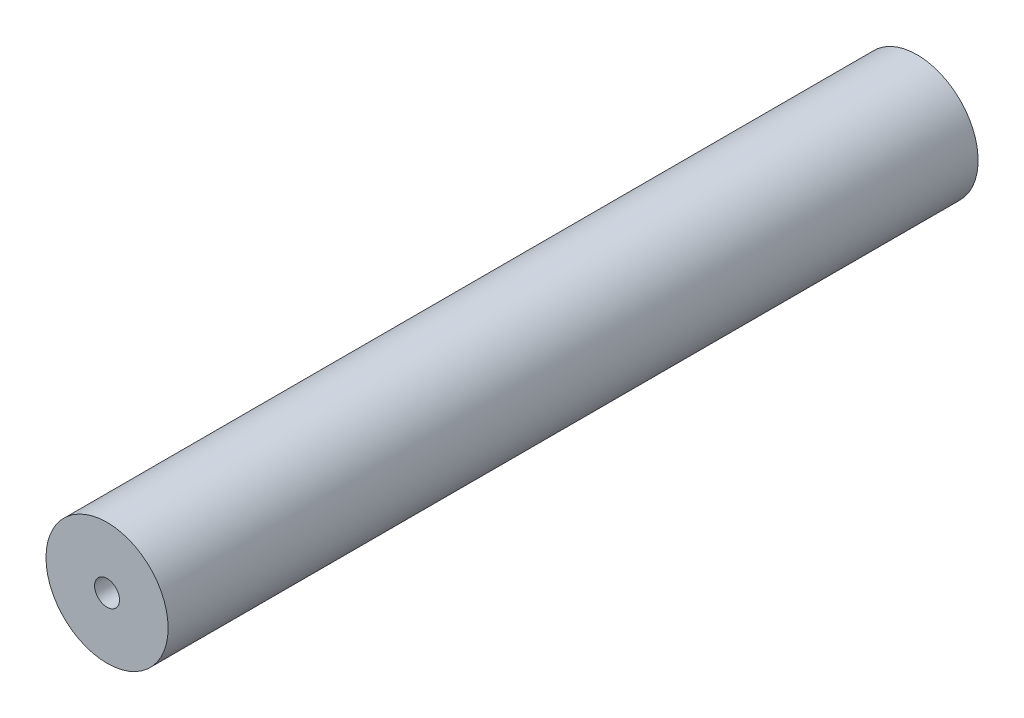
ISO-10303-21;
HEADER;
FILE_DESCRIPTION(('STEP AP214'),'2;1');
FILE_NAME('part.step','',(''),(''),'','','');
FILE_SCHEMA(('AUTOMOTIVE_DESIGN { 1 0 10303 214 1 1 1 1 }'));
ENDSEC;
DATA;
#1=APPLICATION_CONTEXT('core data for automotive mechanical design processes');
#2=APPLICATION_PROTOCOL_DEFINITION('international standard','automotive_design',2000,#1);
#3=PRODUCT_CONTEXT('',#1,'mechanical');
#4=PRODUCT('Part','Part','',(#3));
#5=PRODUCT_RELATED_PRODUCT_CATEGORY('part','',(#4));
#6=PRODUCT_DEFINITION_FORMATION('','',#4);
#7=PRODUCT_DEFINITION_CONTEXT('part definition',#1,'design');
#8=PRODUCT_DEFINITION('design','',#6,#7);
#9=PRODUCT_DEFINITION_SHAPE('','',#8);
#10=(LENGTH_UNIT() NAMED_UNIT(*) SI_UNIT(.MILLI.,.METRE.));
#11=(NAMED_UNIT(*) PLANE_ANGLE_UNIT() SI_UNIT($,.RADIAN.));
#12=(NAMED_UNIT(*) SI_UNIT($,.STERADIAN.) SOLID_ANGLE_UNIT());
#13=UNCERTAINTY_MEASURE_WITH_UNIT(LENGTH_MEASURE(1.E-05),#10,'distance_accuracy_value','');
#14=(GEOMETRIC_REPRESENTATION_CONTEXT(3) GLOBAL_UNCERTAINTY_ASSIGNED_CONTEXT((#13)) GLOBAL_UNIT_ASSIGNED_CONTEXT((#10,
#11,#12)) REPRESENTATION_CONTEXT('',''));
#15=CARTESIAN_POINT('',(0.,0.,0.));
#16=DIRECTION('',(0.,0.,1.));
#17=DIRECTION('',(1.,0.,0.));
#18=AXIS2_PLACEMENT_3D('',#15,#16,#17);
#19=CARTESIAN_POINT('',(0.,0.,67.));
#20=DIRECTION('',(0.,0.,-1.));
#21=DIRECTION('',(-1.,0.,0.));
#22=AXIS2_PLACEMENT_3D('',#19,#20,#21);
#23=CYLINDRICAL_SURFACE('',#22,4.9);
#24=CARTESIAN_POINT('',(0.,0.,2.));
#25=DIRECTION('',(0.,0.,-1.));
#26=DIRECTION('',(-1.,0.,0.));
#27=AXIS2_PLACEMENT_3D('',#24,#25,#26);
#28=CIRCLE('',#27,4.9);
#29=CARTESIAN_POINT('',(-4.9,0.,2.));
#30=VERTEX_POINT('',#29);
#31=EDGE_CURVE('E52',#30,#30,#28,.T.);
#32=ORIENTED_EDGE('',*,*,#31,.F.);
#33=EDGE_LOOP('',(#32));
#34=FACE_BOUND('',#33,.T.);
#35=CARTESIAN_POINT('',(0.,0.,67.));
#36=DIRECTION('',(0.,0.,1.));
#37=DIRECTION('',(1.,0.,0.));
#38=AXIS2_PLACEMENT_3D('',#35,#36,#37);
#39=CIRCLE('',#38,4.9);
#40=CARTESIAN_POINT('',(4.9,0.,67.));
#41=VERTEX_POINT('',#40);
#42=EDGE_CURVE('E12',#41,#41,#39,.T.);
#43=ORIENTED_EDGE('',*,*,#42,.F.);
#44=EDGE_LOOP('',(#43));
#45=FACE_BOUND('',#44,.T.);
#46=ADVANCED_FACE('F37',(#34,#45),#23,.T.);
#47=CARTESIAN_POINT('',(0.,0.,67.));
#48=DIRECTION('',(0.,0.,1.));
#49=DIRECTION('',(1.,0.,0.));
#50=AXIS2_PLACEMENT_3D('',#47,#48,#49);
#51=PLANE('',#50);
#52=CARTESIAN_POINT('',(0.,0.,67.));
#53=DIRECTION('',(0.,0.,1.));
#54=DIRECTION('',(1.,0.,0.));
#55=AXIS2_PLACEMENT_3D('',#52,#53,#54);
#56=CIRCLE('',#55,1.);
#57=CARTESIAN_POINT('',(1.,0.,67.));
#58=VERTEX_POINT('',#57);
#59=EDGE_CURVE('E47',#58,#58,#56,.T.);
#60=ORIENTED_EDGE('',*,*,#59,.F.);
#61=EDGE_LOOP('',(#60));
#62=FACE_BOUND('',#61,.T.);
#63=ORIENTED_EDGE('',*,*,#42,.T.);
#64=EDGE_LOOP('',(#63));
#65=FACE_BOUND('',#64,.T.);
#66=ADVANCED_FACE('F61',(#62,#65),#51,.T.);
#67=CARTESIAN_POINT('',(0.,0.,62.));
#68=DIRECTION('',(0.,0.,1.));
#69=DIRECTION('',(1.,0.,0.));
#70=AXIS2_PLACEMENT_3D('',#67,#68,#69);
#71=CYLINDRICAL_SURFACE('',#70,1.);
#72=CARTESIAN_POINT('',(0.,0.,62.));
#73=DIRECTION('',(0.,0.,1.));
#74=DIRECTION('',(1.,0.,0.));
#75=AXIS2_PLACEMENT_3D('',#72,#73,#74);
#76=CIRCLE('',#75,1.);
#77=CARTESIAN_POINT('',(1.,0.,62.));
#78=VERTEX_POINT('',#77);
#79=EDGE_CURVE('E43',#78,#78,#76,.T.);
#80=ORIENTED_EDGE('',*,*,#79,.F.);
#81=EDGE_LOOP('',(#80));
#82=FACE_BOUND('',#81,.T.);
#83=ORIENTED_EDGE('',*,*,#59,.T.);
#84=EDGE_LOOP('',(#83));
#85=FACE_BOUND('',#84,.T.);
#86=ADVANCED_FACE('F65',(#82,#85),#71,.F.);
#87=CARTESIAN_POINT('',(0.,0.,62.));
#88=DIRECTION('',(0.,0.,1.));
#89=DIRECTION('',(1.,0.,0.));
#90=AXIS2_PLACEMENT_3D('',#87,#88,#89);
#91=PLANE('',#90);
#92=ORIENTED_EDGE('',*,*,#79,.T.);
#93=EDGE_LOOP('',(#92));
#94=FACE_BOUND('',#93,.T.);
#95=ADVANCED_FACE('F70',(#94),#91,.T.);
#96=CARTESIAN_POINT('',(-4.9,-17.5,2.));
#97=DIRECTION('',(0.,0.,-1.));
#98=DIRECTION('',(-1.,0.,0.));
#99=AXIS2_PLACEMENT_3D('',#96,#97,#98);
#100=PLANE('',#99);
#101=ORIENTED_EDGE('',*,*,#31,.T.);
#102=EDGE_LOOP('',(#101));
#103=FACE_BOUND('',#102,.T.);
#104=ADVANCED_FACE('F57',(#103),#100,.T.);
#105=CLOSED_SHELL('',(#46,#66,#86,#95,#104));
#106=MANIFOLD_SOLID_BREP('B2',#105);
#107=ADVANCED_BREP_SHAPE_REPRESENTATION('',(#18,#106),#14);
#108=SHAPE_DEFINITION_REPRESENTATION(#9,#107);
ENDSEC;
END-ISO-10303-21;
